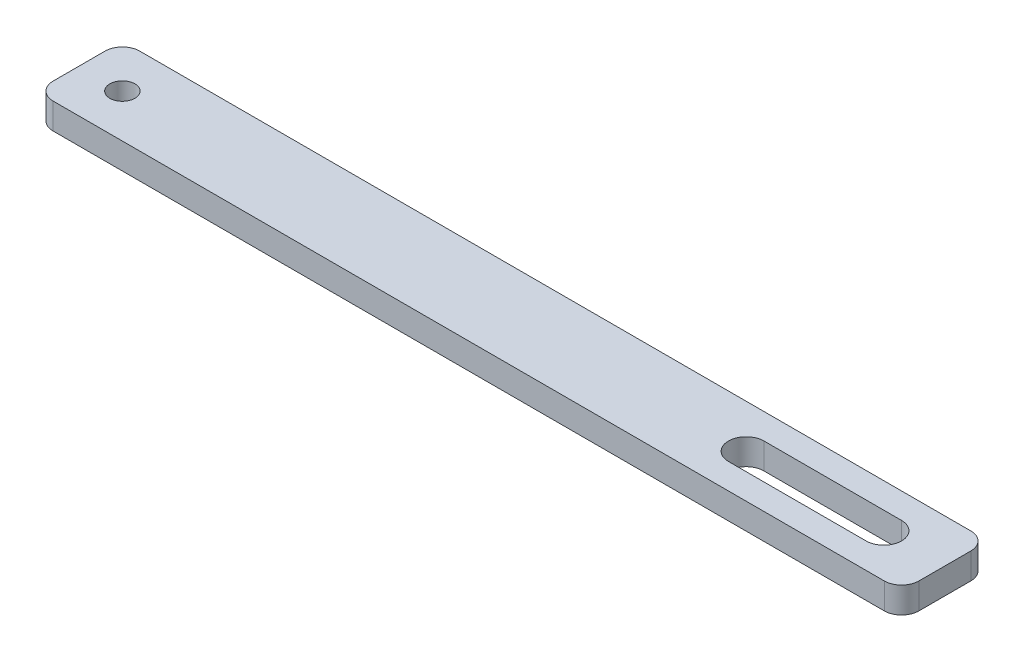
ISO-10303-21;
HEADER;
FILE_DESCRIPTION(('STEP AP214'),'2;1');
FILE_NAME('part.step','',(''),(''),'','','');
FILE_SCHEMA(('AUTOMOTIVE_DESIGN { 1 0 10303 214 1 1 1 1 }'));
ENDSEC;
DATA;
#1=APPLICATION_CONTEXT('core data for automotive mechanical design processes');
#2=APPLICATION_PROTOCOL_DEFINITION('international standard','automotive_design',2000,#1);
#3=PRODUCT_CONTEXT('',#1,'mechanical');
#4=PRODUCT('Part','Part','',(#3));
#5=PRODUCT_RELATED_PRODUCT_CATEGORY('part','',(#4));
#6=PRODUCT_DEFINITION_FORMATION('','',#4);
#7=PRODUCT_DEFINITION_CONTEXT('part definition',#1,'design');
#8=PRODUCT_DEFINITION('design','',#6,#7);
#9=PRODUCT_DEFINITION_SHAPE('','',#8);
#10=(LENGTH_UNIT() NAMED_UNIT(*) SI_UNIT(.MILLI.,.METRE.));
#11=(NAMED_UNIT(*) PLANE_ANGLE_UNIT() SI_UNIT($,.RADIAN.));
#12=(NAMED_UNIT(*) SI_UNIT($,.STERADIAN.) SOLID_ANGLE_UNIT());
#13=UNCERTAINTY_MEASURE_WITH_UNIT(LENGTH_MEASURE(1.E-05),#10,'distance_accuracy_value','');
#14=(GEOMETRIC_REPRESENTATION_CONTEXT(3) GLOBAL_UNCERTAINTY_ASSIGNED_CONTEXT((#13)) GLOBAL_UNIT_ASSIGNED_CONTEXT((#10,
#11,#12)) REPRESENTATION_CONTEXT('',''));
#15=CARTESIAN_POINT('',(0.,0.,0.));
#16=DIRECTION('',(0.,0.,1.));
#17=DIRECTION('',(1.,0.,0.));
#18=AXIS2_PLACEMENT_3D('',#15,#16,#17);
#19=CARTESIAN_POINT('',(-249.999999999998,-7.50000000000001,-25.000000000003));
#20=DIRECTION('',(0.,0.,1.));
#21=DIRECTION('',(1.,0.,0.));
#22=AXIS2_PLACEMENT_3D('',#19,#20,#21);
#23=PLANE('',#22);
#24=DIRECTION('',(1.,0.,0.));
#25=VECTOR('',#24,1.);
#26=CARTESIAN_POINT('',(-249.999999999998,7.4999999999999,-25.0000000000027));
#27=LINE('',#26,#25);
#28=CARTESIAN_POINT('',(-239.999999999997,7.49999999999995,-25.0000000000004));
#29=VERTEX_POINT('',#28);
#30=CARTESIAN_POINT('',(240.,7.50000000000017,-24.9999999999995));
#31=VERTEX_POINT('',#30);
#32=EDGE_CURVE('E197',#29,#31,#27,.T.);
#33=ORIENTED_EDGE('',*,*,#32,.T.);
#34=DIRECTION('',(0.,-1.,0.));
#35=VECTOR('',#34,1.);
#36=CARTESIAN_POINT('',(240.000000000001,-7.4999999999998,-24.9999999999995));
#37=LINE('',#36,#35);
#38=CARTESIAN_POINT('',(240.000000000001,-7.4999999999998,-24.9999999999995));
#39=VERTEX_POINT('',#38);
#40=EDGE_CURVE('E223',#31,#39,#37,.T.);
#41=ORIENTED_EDGE('',*,*,#40,.T.);
#42=DIRECTION('',(1.,0.,0.));
#43=VECTOR('',#42,1.);
#44=CARTESIAN_POINT('',(-249.999999999998,-7.50000000000001,-25.000000000003));
#45=LINE('',#44,#43);
#46=CARTESIAN_POINT('',(-240.,-7.50000000000006,-24.999999999997));
#47=VERTEX_POINT('',#46);
#48=EDGE_CURVE('E216',#47,#39,#45,.T.);
#49=ORIENTED_EDGE('',*,*,#48,.F.);
#50=DIRECTION('',(0.,-1.,0.));
#51=VECTOR('',#50,1.);
#52=CARTESIAN_POINT('',(-240.,-7.50000000000006,-24.999999999997));
#53=LINE('',#52,#51);
#54=EDGE_CURVE('E220',#47,#29,#53,.F.);
#55=ORIENTED_EDGE('',*,*,#54,.T.);
#56=EDGE_LOOP('',(#33,#41,#49,#55));
#57=FACE_BOUND('',#56,.T.);
#58=ADVANCED_FACE('F40',(#57),#23,.F.);
#59=CARTESIAN_POINT('',(-249.999999999998,-7.50000000000001,-25.000000000003));
#60=DIRECTION('',(0.,1.,0.));
#61=DIRECTION('',(-1.,0.,0.));
#62=AXIS2_PLACEMENT_3D('',#59,#60,#61);
#63=PLANE('',#62);
#64=CARTESIAN_POINT('',(-225.,-7.50000000000006,1.22124532708767E-12));
#65=DIRECTION('',(0.,1.,0.));
#66=DIRECTION('',(-1.,0.,0.));
#67=AXIS2_PLACEMENT_3D('',#64,#65,#66);
#68=CIRCLE('',#67,7.25);
#69=CARTESIAN_POINT('',(-232.25,-7.50000000000006,1.22124532708767E-12));
#70=VERTEX_POINT('',#69);
#71=EDGE_CURVE('E202',#70,#70,#68,.F.);
#72=ORIENTED_EDGE('',*,*,#71,.F.);
#73=EDGE_LOOP('',(#72));
#74=FACE_BOUND('',#73,.T.);
#75=DIRECTION('',(-1.,0.,0.));
#76=VECTOR('',#75,1.);
#77=CARTESIAN_POINT('',(214.750000000001,-7.49999999999994,10.249999999996));
#78=LINE('',#77,#76);
#79=CARTESIAN_POINT('',(214.750000000001,-7.49999999999994,10.2499999999961));
#80=VERTEX_POINT('',#79);
#81=CARTESIAN_POINT('',(135.25,-7.49999999999992,10.2499999999992));
#82=VERTEX_POINT('',#81);
#83=EDGE_CURVE('E160',#80,#82,#78,.T.);
#84=ORIENTED_EDGE('',*,*,#83,.F.);
#85=CARTESIAN_POINT('',(214.750000000001,-7.49999999999994,-4.44089209850063E-12));
#86=DIRECTION('',(0.,1.,0.));
#87=DIRECTION('',(-1.,0.,0.));
#88=AXIS2_PLACEMENT_3D('',#85,#86,#87);
#89=CIRCLE('',#88,10.25);
#90=CARTESIAN_POINT('',(214.750000000001,-7.49999999999987,-10.2500000000036));
#91=VERTEX_POINT('',#90);
#92=EDGE_CURVE('E136',#91,#80,#89,.F.);
#93=ORIENTED_EDGE('',*,*,#92,.F.);
#94=DIRECTION('',(1.,0.,0.));
#95=VECTOR('',#94,1.);
#96=CARTESIAN_POINT('',(214.750000000001,-7.49999999999987,-10.2500000000036));
#97=LINE('',#96,#95);
#98=CARTESIAN_POINT('',(135.25,-7.49999999999992,-10.2500000000006));
#99=VERTEX_POINT('',#98);
#100=EDGE_CURVE('E149',#99,#91,#97,.T.);
#101=ORIENTED_EDGE('',*,*,#100,.F.);
#102=CARTESIAN_POINT('',(135.249999999999,-7.49999999999989,-6.66133814775094E-13));
#103=DIRECTION('',(0.,1.,0.));
#104=DIRECTION('',(-1.,0.,0.));
#105=AXIS2_PLACEMENT_3D('',#102,#103,#104);
#106=CIRCLE('',#105,10.25);
#107=EDGE_CURVE('E168',#82,#99,#106,.F.);
#108=ORIENTED_EDGE('',*,*,#107,.F.);
#109=EDGE_LOOP('',(#84,#93,#101,#108));
#110=FACE_BOUND('',#109,.T.);
#111=ORIENTED_EDGE('',*,*,#48,.T.);
#112=CARTESIAN_POINT('',(240.,-7.49999999999989,-14.9999999999996));
#113=DIRECTION('',(0.,1.,0.));
#114=DIRECTION('',(-1.,0.,0.));
#115=AXIS2_PLACEMENT_3D('',#112,#113,#114);
#116=CIRCLE('',#115,10.);
#117=CARTESIAN_POINT('',(249.999999999999,-7.49999999999985,-14.9999999999998));
#118=VERTEX_POINT('',#117);
#119=EDGE_CURVE('E236',#39,#118,#116,.F.);
#120=ORIENTED_EDGE('',*,*,#119,.T.);
#121=DIRECTION('',(0.,0.,1.));
#122=VECTOR('',#121,1.);
#123=CARTESIAN_POINT('',(250.,-7.49999999999985,-25.0000000000027));
#124=LINE('',#123,#122);
#125=CARTESIAN_POINT('',(250.,-7.49999999999987,14.9999999999988));
#126=VERTEX_POINT('',#125);
#127=EDGE_CURVE('E198',#118,#126,#124,.T.);
#128=ORIENTED_EDGE('',*,*,#127,.T.);
#129=CARTESIAN_POINT('',(240.,-7.49999999999989,14.9999999999997));
#130=DIRECTION('',(0.,1.,0.));
#131=DIRECTION('',(-1.,0.,0.));
#132=AXIS2_PLACEMENT_3D('',#129,#130,#131);
#133=CIRCLE('',#132,10.);
#134=CARTESIAN_POINT('',(240.,-7.49999999999989,24.9999999999962));
#135=VERTEX_POINT('',#134);
#136=EDGE_CURVE('E233',#126,#135,#133,.F.);
#137=ORIENTED_EDGE('',*,*,#136,.T.);
#138=DIRECTION('',(1.,0.,0.));
#139=VECTOR('',#138,1.);
#140=CARTESIAN_POINT('',(-250.,-7.50000000000006,25.));
#141=LINE('',#140,#139);
#142=CARTESIAN_POINT('',(-239.999999999999,-7.50000000000014,24.9999999999998));
#143=VERTEX_POINT('',#142);
#144=EDGE_CURVE('E212',#143,#135,#141,.T.);
#145=ORIENTED_EDGE('',*,*,#144,.F.);
#146=CARTESIAN_POINT('',(-240.,-7.50000000000008,14.999999999998));
#147=DIRECTION('',(0.,1.,0.));
#148=DIRECTION('',(-1.,0.,0.));
#149=AXIS2_PLACEMENT_3D('',#146,#147,#148);
#150=CIRCLE('',#149,10.);
#151=CARTESIAN_POINT('',(-249.999999999999,-7.50000000000006,15.0000000000002));
#152=VERTEX_POINT('',#151);
#153=EDGE_CURVE('E230',#143,#152,#150,.F.);
#154=ORIENTED_EDGE('',*,*,#153,.T.);
#155=DIRECTION('',(0.,0.,1.));
#156=VECTOR('',#155,1.);
#157=CARTESIAN_POINT('',(-249.999999999998,-7.50000000000001,-25.000000000003));
#158=LINE('',#157,#156);
#159=CARTESIAN_POINT('',(-250.,-7.50000000000006,-14.999999999998));
#160=VERTEX_POINT('',#159);
#161=EDGE_CURVE('E188',#160,#152,#158,.T.);
#162=ORIENTED_EDGE('',*,*,#161,.F.);
#163=CARTESIAN_POINT('',(-239.999999999998,-7.50000000000008,-14.9999999999992));
#164=DIRECTION('',(0.,1.,0.));
#165=DIRECTION('',(-1.,0.,0.));
#166=AXIS2_PLACEMENT_3D('',#163,#164,#165);
#167=CIRCLE('',#166,10.);
#168=EDGE_CURVE('E227',#160,#47,#167,.F.);
#169=ORIENTED_EDGE('',*,*,#168,.T.);
#170=EDGE_LOOP('',(#111,#120,#128,#137,#145,#154,#162,#169));
#171=FACE_BOUND('',#170,.T.);
#172=ADVANCED_FACE('F157',(#74,#110,#171),#63,.F.);
#173=CARTESIAN_POINT('',(-249.999999999999,7.50000000000001,24.9999999999989));
#174=DIRECTION('',(0.,0.,-1.));
#175=DIRECTION('',(-1.,0.,0.));
#176=AXIS2_PLACEMENT_3D('',#173,#174,#175);
#177=PLANE('',#176);
#178=ORIENTED_EDGE('',*,*,#144,.T.);
#179=DIRECTION('',(0.,1.,0.));
#180=VECTOR('',#179,1.);
#181=CARTESIAN_POINT('',(240.,7.50000000000012,24.9999999999966));
#182=LINE('',#181,#180);
#183=CARTESIAN_POINT('',(240.,7.50000000000012,24.9999999999966));
#184=VERTEX_POINT('',#183);
#185=EDGE_CURVE('E258',#135,#184,#182,.T.);
#186=ORIENTED_EDGE('',*,*,#185,.T.);
#187=DIRECTION('',(1.,0.,0.));
#188=VECTOR('',#187,1.);
#189=CARTESIAN_POINT('',(-249.999999999999,7.50000000000001,24.9999999999989));
#190=LINE('',#189,#188);
#191=CARTESIAN_POINT('',(-240.,7.49999999999988,24.9999999999999));
#192=VERTEX_POINT('',#191);
#193=EDGE_CURVE('E209',#192,#184,#190,.T.);
#194=ORIENTED_EDGE('',*,*,#193,.F.);
#195=DIRECTION('',(0.,1.,0.));
#196=VECTOR('',#195,1.);
#197=CARTESIAN_POINT('',(-240.,7.49999999999988,24.9999999999999));
#198=LINE('',#197,#196);
#199=EDGE_CURVE('E255',#192,#143,#198,.F.);
#200=ORIENTED_EDGE('',*,*,#199,.T.);
#201=EDGE_LOOP('',(#178,#186,#194,#200));
#202=FACE_BOUND('',#201,.T.);
#203=ADVANCED_FACE('F293',(#202),#177,.F.);
#204=CARTESIAN_POINT('',(-249.999999999998,7.4999999999999,-25.0000000000027));
#205=DIRECTION('',(0.,-1.,0.));
#206=DIRECTION('',(1.,0.,0.));
#207=AXIS2_PLACEMENT_3D('',#204,#205,#206);
#208=PLANE('',#207);
#209=CARTESIAN_POINT('',(-224.999999999999,7.50000000000001,1.88737914186277E-12));
#210=DIRECTION('',(0.,1.,0.));
#211=DIRECTION('',(0.,0.,1.));
#212=AXIS2_PLACEMENT_3D('',#209,#210,#211);
#213=CIRCLE('',#212,7.25);
#214=CARTESIAN_POINT('',(-224.999999999999,7.50000000000001,7.25000000000189));
#215=VERTEX_POINT('',#214);
#216=EDGE_CURVE('E154',#215,#215,#213,.T.);
#217=ORIENTED_EDGE('',*,*,#216,.F.);
#218=EDGE_LOOP('',(#217));
#219=FACE_BOUND('',#218,.T.);
#220=DIRECTION('',(-1.,0.,0.));
#221=VECTOR('',#220,1.);
#222=CARTESIAN_POINT('',(214.750000000001,7.50000000000004,-10.2500000000035));
#223=LINE('',#222,#221);
#224=CARTESIAN_POINT('',(214.750000000001,7.50000000000009,-10.2500000000033));
#225=VERTEX_POINT('',#224);
#226=CARTESIAN_POINT('',(135.25,7.50000000000006,-10.2500000000003));
#227=VERTEX_POINT('',#226);
#228=EDGE_CURVE('E165',#225,#227,#223,.T.);
#229=ORIENTED_EDGE('',*,*,#228,.F.);
#230=CARTESIAN_POINT('',(214.750000000001,7.50000000000001,-3.99680288865056E-12));
#231=DIRECTION('',(0.,1.,0.));
#232=DIRECTION('',(0.,0.,1.));
#233=AXIS2_PLACEMENT_3D('',#230,#231,#232);
#234=CIRCLE('',#233,10.25);
#235=CARTESIAN_POINT('',(214.750000000001,7.50000000000001,10.2499999999962));
#236=VERTEX_POINT('',#235);
#237=EDGE_CURVE('E139',#236,#225,#234,.T.);
#238=ORIENTED_EDGE('',*,*,#237,.F.);
#239=DIRECTION('',(1.,0.,0.));
#240=VECTOR('',#239,1.);
#241=CARTESIAN_POINT('',(214.750000000001,7.50000000000001,10.2499999999962));
#242=LINE('',#241,#240);
#243=CARTESIAN_POINT('',(135.25,7.50000000000001,10.2499999999993));
#244=VERTEX_POINT('',#243);
#245=EDGE_CURVE('E145',#244,#236,#242,.T.);
#246=ORIENTED_EDGE('',*,*,#245,.F.);
#247=CARTESIAN_POINT('',(135.25,7.50000000000004,-6.66133814775094E-13));
#248=DIRECTION('',(0.,1.,0.));
#249=DIRECTION('',(0.,0.,1.));
#250=AXIS2_PLACEMENT_3D('',#247,#248,#249);
#251=CIRCLE('',#250,10.25);
#252=EDGE_CURVE('E174',#227,#244,#251,.T.);
#253=ORIENTED_EDGE('',*,*,#252,.F.);
#254=EDGE_LOOP('',(#229,#238,#246,#253));
#255=FACE_BOUND('',#254,.T.);
#256=DIRECTION('',(0.,0.,-1.));
#257=VECTOR('',#256,1.);
#258=CARTESIAN_POINT('',(250.,7.50000000000012,-25.000000000002));
#259=LINE('',#258,#257);
#260=CARTESIAN_POINT('',(250.,7.50000000000012,14.9999999999988));
#261=VERTEX_POINT('',#260);
#262=CARTESIAN_POINT('',(250.,7.50000000000012,-14.9999999999992));
#263=VERTEX_POINT('',#262);
#264=EDGE_CURVE('E193',#261,#263,#259,.T.);
#265=ORIENTED_EDGE('',*,*,#264,.T.);
#266=CARTESIAN_POINT('',(240.,7.50000000000009,-14.9999999999998));
#267=DIRECTION('',(0.,-1.,0.));
#268=DIRECTION('',(1.,0.,0.));
#269=AXIS2_PLACEMENT_3D('',#266,#267,#268);
#270=CIRCLE('',#269,10.);
#271=EDGE_CURVE('E252',#263,#31,#270,.F.);
#272=ORIENTED_EDGE('',*,*,#271,.T.);
#273=ORIENTED_EDGE('',*,*,#32,.F.);
#274=CARTESIAN_POINT('',(-239.999999999999,7.49999999999982,-14.9999999999993));
#275=DIRECTION('',(0.,-1.,0.));
#276=DIRECTION('',(1.,0.,0.));
#277=AXIS2_PLACEMENT_3D('',#274,#275,#276);
#278=CIRCLE('',#277,10.);
#279=CARTESIAN_POINT('',(-249.999999999999,7.49999999999995,-14.9999999999976));
#280=VERTEX_POINT('',#279);
#281=EDGE_CURVE('E245',#29,#280,#278,.F.);
#282=ORIENTED_EDGE('',*,*,#281,.T.);
#283=DIRECTION('',(0.,0.,-1.));
#284=VECTOR('',#283,1.);
#285=CARTESIAN_POINT('',(-249.999999999998,7.4999999999999,-25.0000000000027));
#286=LINE('',#285,#284);
#287=CARTESIAN_POINT('',(-250.,7.50000000000001,15.0000000000008));
#288=VERTEX_POINT('',#287);
#289=EDGE_CURVE('E192',#288,#280,#286,.T.);
#290=ORIENTED_EDGE('',*,*,#289,.F.);
#291=CARTESIAN_POINT('',(-239.999999999999,7.49999999999988,14.999999999998));
#292=DIRECTION('',(0.,-1.,0.));
#293=DIRECTION('',(1.,0.,0.));
#294=AXIS2_PLACEMENT_3D('',#291,#292,#293);
#295=CIRCLE('',#294,10.);
#296=EDGE_CURVE('E64',#288,#192,#295,.F.);
#297=ORIENTED_EDGE('',*,*,#296,.T.);
#298=ORIENTED_EDGE('',*,*,#193,.T.);
#299=CARTESIAN_POINT('',(240.,7.50000000000009,15.0000000000002));
#300=DIRECTION('',(0.,-1.,0.));
#301=DIRECTION('',(1.,0.,0.));
#302=AXIS2_PLACEMENT_3D('',#299,#300,#301);
#303=CIRCLE('',#302,10.);
#304=EDGE_CURVE('E56',#184,#261,#303,.F.);
#305=ORIENTED_EDGE('',*,*,#304,.T.);
#306=EDGE_LOOP('',(#265,#272,#273,#282,#290,#297,#298,#305));
#307=FACE_BOUND('',#306,.T.);
#308=ADVANCED_FACE('F277',(#219,#255,#307),#208,.F.);
#309=CARTESIAN_POINT('',(-250.000000000002,-1.11022302462515E-13,-1.66533453693773E-12));
#310=DIRECTION('',(1.,0.,0.));
#311=DIRECTION('',(0.,0.,-1.));
#312=AXIS2_PLACEMENT_3D('',#309,#310,#311);
#313=PLANE('',#312);
#314=ORIENTED_EDGE('',*,*,#161,.T.);
#315=DIRECTION('',(0.,1.,0.));
#316=VECTOR('',#315,1.);
#317=CARTESIAN_POINT('',(-250.,-1.11022302462513E-13,15.0000000000007));
#318=LINE('',#317,#316);
#319=EDGE_CURVE('E11',#152,#288,#318,.T.);
#320=ORIENTED_EDGE('',*,*,#319,.T.);
#321=ORIENTED_EDGE('',*,*,#289,.T.);
#322=DIRECTION('',(0.,-1.,0.));
#323=VECTOR('',#322,1.);
#324=CARTESIAN_POINT('',(-249.999999999999,-1.1102230246251E-13,-14.9999999999976));
#325=LINE('',#324,#323);
#326=EDGE_CURVE('E49',#280,#160,#325,.T.);
#327=ORIENTED_EDGE('',*,*,#326,.T.);
#328=EDGE_LOOP('',(#314,#320,#321,#327));
#329=FACE_BOUND('',#328,.T.);
#330=ADVANCED_FACE('F267',(#329),#313,.F.);
#331=CARTESIAN_POINT('',(250.,0.,-2.88657986402541E-12));
#332=DIRECTION('',(1.,0.,0.));
#333=DIRECTION('',(0.,0.,-1.));
#334=AXIS2_PLACEMENT_3D('',#331,#332,#333);
#335=PLANE('',#334);
#336=ORIENTED_EDGE('',*,*,#127,.F.);
#337=DIRECTION('',(0.,-1.,0.));
#338=VECTOR('',#337,1.);
#339=CARTESIAN_POINT('',(250.,7.50000000000012,-14.9999999999992));
#340=LINE('',#339,#338);
#341=EDGE_CURVE('E242',#118,#263,#340,.F.);
#342=ORIENTED_EDGE('',*,*,#341,.T.);
#343=ORIENTED_EDGE('',*,*,#264,.F.);
#344=DIRECTION('',(0.,1.,0.));
#345=VECTOR('',#344,1.);
#346=CARTESIAN_POINT('',(250.,-7.49999999999987,14.9999999999988));
#347=LINE('',#346,#345);
#348=EDGE_CURVE('E239',#261,#126,#347,.F.);
#349=ORIENTED_EDGE('',*,*,#348,.T.);
#350=EDGE_LOOP('',(#336,#342,#343,#349));
#351=FACE_BOUND('',#350,.T.);
#352=ADVANCED_FACE('F287',(#351),#335,.T.);
#353=CARTESIAN_POINT('',(214.750000000001,-7.50100000000011,-4.44089209850063E-12));
#354=DIRECTION('',(0.,1.,0.));
#355=DIRECTION('',(0.,0.,1.));
#356=AXIS2_PLACEMENT_3D('',#353,#354,#355);
#357=CYLINDRICAL_SURFACE('',#356,10.25);
#358=ORIENTED_EDGE('',*,*,#92,.T.);
#359=DIRECTION('',(0.,1.,0.));
#360=VECTOR('',#359,1.);
#361=CARTESIAN_POINT('',(214.750000000001,-7.50100000000011,10.249999999996));
#362=LINE('',#361,#360);
#363=EDGE_CURVE('E155',#80,#236,#362,.T.);
#364=ORIENTED_EDGE('',*,*,#363,.T.);
#365=ORIENTED_EDGE('',*,*,#237,.T.);
#366=DIRECTION('',(0.,1.,0.));
#367=VECTOR('',#366,1.);
#368=CARTESIAN_POINT('',(214.750000000001,-7.50100000000001,-10.2500000000036));
#369=LINE('',#368,#367);
#370=EDGE_CURVE('E132',#91,#225,#369,.T.);
#371=ORIENTED_EDGE('',*,*,#370,.F.);
#372=EDGE_LOOP('',(#358,#364,#365,#371));
#373=FACE_BOUND('',#372,.T.);
#374=ADVANCED_FACE('F134',(#373),#357,.F.);
#375=CARTESIAN_POINT('',(214.750000000001,-7.50100000000011,10.249999999996));
#376=DIRECTION('',(0.,0.,1.));
#377=DIRECTION('',(1.,0.,0.));
#378=AXIS2_PLACEMENT_3D('',#375,#376,#377);
#379=PLANE('',#378);
#380=ORIENTED_EDGE('',*,*,#83,.T.);
#381=DIRECTION('',(0.,1.,0.));
#382=VECTOR('',#381,1.);
#383=CARTESIAN_POINT('',(135.25,-7.50100000000003,10.2499999999993));
#384=LINE('',#383,#382);
#385=EDGE_CURVE('E183',#82,#244,#384,.T.);
#386=ORIENTED_EDGE('',*,*,#385,.T.);
#387=ORIENTED_EDGE('',*,*,#245,.T.);
#388=ORIENTED_EDGE('',*,*,#363,.F.);
#389=EDGE_LOOP('',(#380,#386,#387,#388));
#390=FACE_BOUND('',#389,.T.);
#391=ADVANCED_FACE('F370',(#390),#379,.F.);
#392=CARTESIAN_POINT('',(135.249999999999,-7.50100000000003,-6.66133814775094E-13));
#393=DIRECTION('',(0.,1.,0.));
#394=DIRECTION('',(0.,0.,1.));
#395=AXIS2_PLACEMENT_3D('',#392,#393,#394);
#396=CYLINDRICAL_SURFACE('',#395,10.25);
#397=ORIENTED_EDGE('',*,*,#107,.T.);
#398=DIRECTION('',(0.,1.,0.));
#399=VECTOR('',#398,1.);
#400=CARTESIAN_POINT('',(135.25,-7.50100000000003,-10.2500000000006));
#401=LINE('',#400,#399);
#402=EDGE_CURVE('E144',#99,#227,#401,.T.);
#403=ORIENTED_EDGE('',*,*,#402,.T.);
#404=ORIENTED_EDGE('',*,*,#252,.T.);
#405=ORIENTED_EDGE('',*,*,#385,.F.);
#406=EDGE_LOOP('',(#397,#403,#404,#405));
#407=FACE_BOUND('',#406,.T.);
#408=ADVANCED_FACE('F360',(#407),#396,.F.);
#409=CARTESIAN_POINT('',(214.750000000001,-7.50100000000001,-10.2500000000036));
#410=DIRECTION('',(0.,0.,-1.));
#411=DIRECTION('',(-1.,0.,0.));
#412=AXIS2_PLACEMENT_3D('',#409,#410,#411);
#413=PLANE('',#412);
#414=ORIENTED_EDGE('',*,*,#100,.T.);
#415=ORIENTED_EDGE('',*,*,#370,.T.);
#416=ORIENTED_EDGE('',*,*,#228,.T.);
#417=ORIENTED_EDGE('',*,*,#402,.F.);
#418=EDGE_LOOP('',(#414,#415,#416,#417));
#419=FACE_BOUND('',#418,.T.);
#420=ADVANCED_FACE('F150',(#419),#413,.F.);
#421=CARTESIAN_POINT('',(-225.,-7.50100000000003,9.99200722162641E-13));
#422=DIRECTION('',(0.,1.,0.));
#423=DIRECTION('',(0.,0.,1.));
#424=AXIS2_PLACEMENT_3D('',#421,#422,#423);
#425=CYLINDRICAL_SURFACE('',#424,7.25);
#426=ORIENTED_EDGE('',*,*,#216,.T.);
#427=EDGE_LOOP('',(#426));
#428=FACE_BOUND('',#427,.T.);
#429=ORIENTED_EDGE('',*,*,#71,.T.);
#430=EDGE_LOOP('',(#429));
#431=FACE_BOUND('',#430,.T.);
#432=ADVANCED_FACE('F311',(#428,#431),#425,.F.);
#433=CARTESIAN_POINT('',(240.,-7.50000000000006,-14.9999999999995));
#434=DIRECTION('',(0.,1.,0.));
#435=DIRECTION('',(0.,0.,1.));
#436=AXIS2_PLACEMENT_3D('',#433,#434,#435);
#437=CYLINDRICAL_SURFACE('',#436,10.);
#438=ORIENTED_EDGE('',*,*,#271,.F.);
#439=ORIENTED_EDGE('',*,*,#341,.F.);
#440=ORIENTED_EDGE('',*,*,#119,.F.);
#441=ORIENTED_EDGE('',*,*,#40,.F.);
#442=EDGE_LOOP('',(#438,#439,#440,#441));
#443=FACE_BOUND('',#442,.T.);
#444=ADVANCED_FACE('F290',(#443),#437,.T.);
#445=CARTESIAN_POINT('',(240.,7.49999999999995,15.0000000000002));
#446=DIRECTION('',(0.,-1.,0.));
#447=DIRECTION('',(0.,0.,-1.));
#448=AXIS2_PLACEMENT_3D('',#445,#446,#447);
#449=CYLINDRICAL_SURFACE('',#448,10.);
#450=ORIENTED_EDGE('',*,*,#136,.F.);
#451=ORIENTED_EDGE('',*,*,#348,.F.);
#452=ORIENTED_EDGE('',*,*,#304,.F.);
#453=ORIENTED_EDGE('',*,*,#185,.F.);
#454=EDGE_LOOP('',(#450,#451,#452,#453));
#455=FACE_BOUND('',#454,.T.);
#456=ADVANCED_FACE('F291',(#455),#449,.T.);
#457=CARTESIAN_POINT('',(-240.,-1.66533453693771E-13,14.9999999999985));
#458=DIRECTION('',(0.,1.,0.));
#459=DIRECTION('',(0.,0.,1.));
#460=AXIS2_PLACEMENT_3D('',#457,#458,#459);
#461=CYLINDRICAL_SURFACE('',#460,10.);
#462=ORIENTED_EDGE('',*,*,#153,.F.);
#463=ORIENTED_EDGE('',*,*,#199,.F.);
#464=ORIENTED_EDGE('',*,*,#296,.F.);
#465=ORIENTED_EDGE('',*,*,#319,.F.);
#466=EDGE_LOOP('',(#462,#463,#464,#465));
#467=FACE_BOUND('',#466,.T.);
#468=ADVANCED_FACE('F276',(#467),#461,.T.);
#469=CARTESIAN_POINT('',(-239.999999999998,-1.66533453693771E-13,-14.9999999999991));
#470=DIRECTION('',(0.,-1.,0.));
#471=DIRECTION('',(0.,0.,-1.));
#472=AXIS2_PLACEMENT_3D('',#469,#470,#471);
#473=CYLINDRICAL_SURFACE('',#472,10.);
#474=ORIENTED_EDGE('',*,*,#281,.F.);
#475=ORIENTED_EDGE('',*,*,#54,.F.);
#476=ORIENTED_EDGE('',*,*,#168,.F.);
#477=ORIENTED_EDGE('',*,*,#326,.F.);
#478=EDGE_LOOP('',(#474,#475,#476,#477));
#479=FACE_BOUND('',#478,.T.);
#480=ADVANCED_FACE('F42',(#479),#473,.T.);
#481=CLOSED_SHELL('',(#58,#172,#203,#308,#330,#352,#374,#391,#408,#420,#432,#444,#456,#468,#480));
#482=MANIFOLD_SOLID_BREP('B2',#481);
#483=ADVANCED_BREP_SHAPE_REPRESENTATION('',(#18,#482),#14);
#484=SHAPE_DEFINITION_REPRESENTATION(#9,#483);
ENDSEC;
END-ISO-10303-21;
